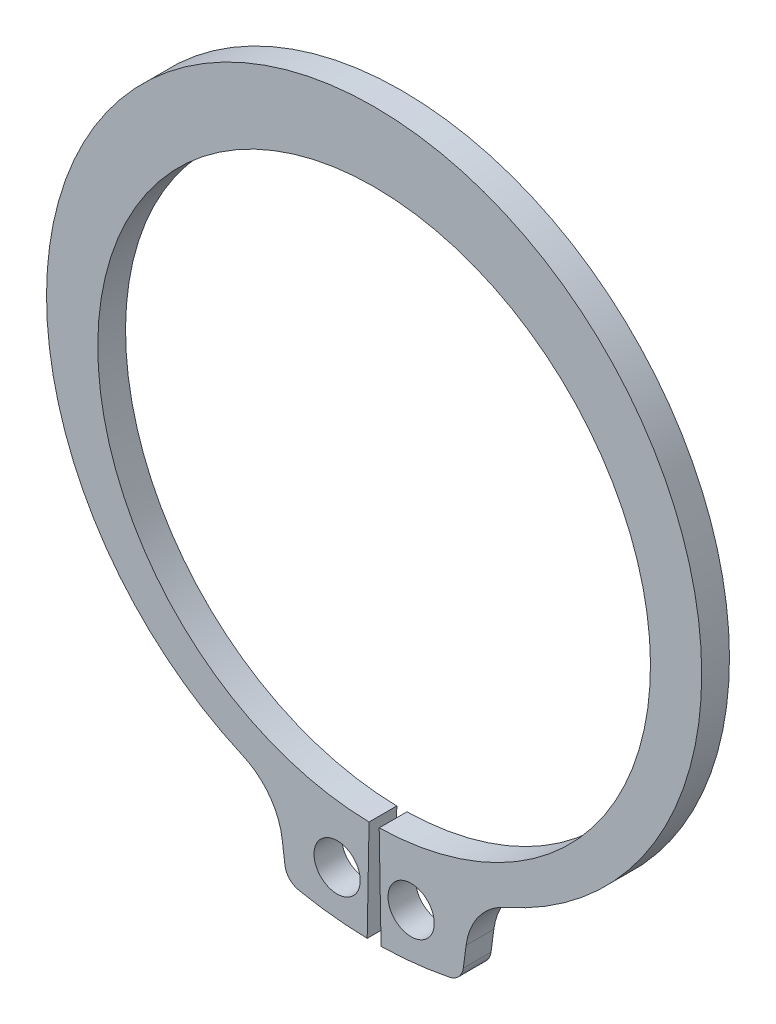
ISO-10303-21;
HEADER;
FILE_DESCRIPTION(('STEP AP214'),'2;1');
FILE_NAME('part.step','',(''),(''),'','','');
FILE_SCHEMA(('AUTOMOTIVE_DESIGN { 1 0 10303 214 1 1 1 1 }'));
ENDSEC;
DATA;
#1=APPLICATION_CONTEXT('core data for automotive mechanical design processes');
#2=APPLICATION_PROTOCOL_DEFINITION('international standard','automotive_design',2000,#1);
#3=PRODUCT_CONTEXT('',#1,'mechanical');
#4=PRODUCT('Part','Part','',(#3));
#5=PRODUCT_RELATED_PRODUCT_CATEGORY('part','',(#4));
#6=PRODUCT_DEFINITION_FORMATION('','',#4);
#7=PRODUCT_DEFINITION_CONTEXT('part definition',#1,'design');
#8=PRODUCT_DEFINITION('design','',#6,#7);
#9=PRODUCT_DEFINITION_SHAPE('','',#8);
#10=(LENGTH_UNIT() NAMED_UNIT(*) SI_UNIT(.MILLI.,.METRE.));
#11=(NAMED_UNIT(*) PLANE_ANGLE_UNIT() SI_UNIT($,.RADIAN.));
#12=(NAMED_UNIT(*) SI_UNIT($,.STERADIAN.) SOLID_ANGLE_UNIT());
#13=UNCERTAINTY_MEASURE_WITH_UNIT(LENGTH_MEASURE(1.E-05),#10,'distance_accuracy_value','');
#14=(GEOMETRIC_REPRESENTATION_CONTEXT(3) GLOBAL_UNCERTAINTY_ASSIGNED_CONTEXT((#13)) GLOBAL_UNIT_ASSIGNED_CONTEXT((#10,
#11,#12)) REPRESENTATION_CONTEXT('',''));
#15=CARTESIAN_POINT('',(0.,0.,0.));
#16=DIRECTION('',(0.,0.,1.));
#17=DIRECTION('',(1.,0.,0.));
#18=AXIS2_PLACEMENT_3D('',#15,#16,#17);
#19=CARTESIAN_POINT('',(0.,0.,-1.2));
#20=DIRECTION('',(0.,0.,1.));
#21=DIRECTION('',(1.,0.,0.));
#22=AXIS2_PLACEMENT_3D('',#19,#20,#21);
#23=CYLINDRICAL_SURFACE('',#22,11.95);
#24=CARTESIAN_POINT('',(0.,0.,0.));
#25=DIRECTION('',(0.,0.,-1.));
#26=DIRECTION('',(1.,0.,0.));
#27=AXIS2_PLACEMENT_3D('',#24,#25,#26);
#28=CIRCLE('',#27,11.95);
#29=CARTESIAN_POINT('',(-0.219266055045872,-11.947988215474,0.));
#30=VERTEX_POINT('',#29);
#31=CARTESIAN_POINT('',(0.219266055045872,-11.947988215474,0.));
#32=VERTEX_POINT('',#31);
#33=EDGE_CURVE('E155',#30,#32,#28,.T.);
#34=ORIENTED_EDGE('',*,*,#33,.F.);
#35=DIRECTION('',(0.,0.,1.));
#36=VECTOR('',#35,1.);
#37=CARTESIAN_POINT('',(-0.219266055045872,-11.947988215474,-1.2));
#38=LINE('',#37,#36);
#39=CARTESIAN_POINT('',(-0.219266055045872,-11.947988215474,-1.2));
#40=VERTEX_POINT('',#39);
#41=EDGE_CURVE('E11',#40,#30,#38,.T.);
#42=ORIENTED_EDGE('',*,*,#41,.F.);
#43=CARTESIAN_POINT('',(0.,0.,-1.2));
#44=DIRECTION('',(0.,0.,-1.));
#45=DIRECTION('',(1.,0.,0.));
#46=AXIS2_PLACEMENT_3D('',#43,#44,#45);
#47=CIRCLE('',#46,11.95);
#48=CARTESIAN_POINT('',(0.219266055045872,-11.947988215474,-1.2));
#49=VERTEX_POINT('',#48);
#50=EDGE_CURVE('E188',#40,#49,#47,.T.);
#51=ORIENTED_EDGE('',*,*,#50,.T.);
#52=DIRECTION('',(0.,0.,1.));
#53=VECTOR('',#52,1.);
#54=CARTESIAN_POINT('',(0.219266055045872,-11.947988215474,-1.2));
#55=LINE('',#54,#53);
#56=EDGE_CURVE('E37',#49,#32,#55,.T.);
#57=ORIENTED_EDGE('',*,*,#56,.T.);
#58=EDGE_LOOP('',(#34,#42,#51,#57));
#59=FACE_BOUND('',#58,.T.);
#60=ADVANCED_FACE('F34',(#59),#23,.F.);
#61=CARTESIAN_POINT('',(-0.219266055045872,-11.947988215474,-1.2));
#62=DIRECTION('',(0.999831649830457,-0.018348623853211,0.));
#63=DIRECTION('',(0.018348623853211,0.999831649830457,0.));
#64=AXIS2_PLACEMENT_3D('',#61,#62,#63);
#65=PLANE('',#64);
#66=DIRECTION('',(0.018348623853211,0.999831649830457,0.));
#67=VECTOR('',#66,1.);
#68=CARTESIAN_POINT('',(-0.219266055045872,-11.947988215474,0.));
#69=LINE('',#68,#67);
#70=CARTESIAN_POINT('',(-0.3,-16.347247474728,0.));
#71=VERTEX_POINT('',#70);
#72=EDGE_CURVE('E186',#71,#30,#69,.T.);
#73=ORIENTED_EDGE('',*,*,#72,.F.);
#74=DIRECTION('',(0.,0.,1.));
#75=VECTOR('',#74,1.);
#76=CARTESIAN_POINT('',(-0.3,-16.347247474728,-1.2));
#77=LINE('',#76,#75);
#78=CARTESIAN_POINT('',(-0.3,-16.347247474728,-1.2));
#79=VERTEX_POINT('',#78);
#80=EDGE_CURVE('E43',#79,#71,#77,.T.);
#81=ORIENTED_EDGE('',*,*,#80,.F.);
#82=DIRECTION('',(0.018348623853211,0.999831649830457,0.));
#83=VECTOR('',#82,1.);
#84=CARTESIAN_POINT('',(-0.219266055045872,-11.947988215474,-1.2));
#85=LINE('',#84,#83);
#86=EDGE_CURVE('E145',#79,#40,#85,.T.);
#87=ORIENTED_EDGE('',*,*,#86,.T.);
#88=ORIENTED_EDGE('',*,*,#41,.T.);
#89=EDGE_LOOP('',(#73,#81,#87,#88));
#90=FACE_BOUND('',#89,.T.);
#91=ADVANCED_FACE('F208',(#90),#65,.T.);
#92=CARTESIAN_POINT('',(0.,0.,-1.2));
#93=DIRECTION('',(0.,0.,1.));
#94=DIRECTION('',(1.,0.,0.));
#95=AXIS2_PLACEMENT_3D('',#92,#93,#94);
#96=CYLINDRICAL_SURFACE('',#95,16.35);
#97=CARTESIAN_POINT('',(0.,0.,0.));
#98=DIRECTION('',(0.,0.,1.));
#99=DIRECTION('',(1.,0.,0.));
#100=AXIS2_PLACEMENT_3D('',#97,#98,#99);
#101=CIRCLE('',#100,16.35);
#102=CARTESIAN_POINT('',(-3.26220764845081,-16.0212515509366,0.));
#103=VERTEX_POINT('',#102);
#104=EDGE_CURVE('E132',#103,#71,#101,.T.);
#105=ORIENTED_EDGE('',*,*,#104,.F.);
#106=DIRECTION('',(0.,0.,1.));
#107=VECTOR('',#106,1.);
#108=CARTESIAN_POINT('',(-3.26220764845081,-16.0212515509366,-1.2));
#109=LINE('',#108,#107);
#110=CARTESIAN_POINT('',(-3.26220764845081,-16.0212515509366,-1.2));
#111=VERTEX_POINT('',#110);
#112=EDGE_CURVE('E127',#111,#103,#109,.T.);
#113=ORIENTED_EDGE('',*,*,#112,.F.);
#114=CARTESIAN_POINT('',(0.,0.,-1.2));
#115=DIRECTION('',(0.,0.,1.));
#116=DIRECTION('',(1.,0.,0.));
#117=AXIS2_PLACEMENT_3D('',#114,#115,#116);
#118=CIRCLE('',#117,16.35);
#119=EDGE_CURVE('E130',#111,#79,#118,.T.);
#120=ORIENTED_EDGE('',*,*,#119,.T.);
#121=ORIENTED_EDGE('',*,*,#80,.T.);
#122=EDGE_LOOP('',(#105,#113,#120,#121));
#123=FACE_BOUND('',#122,.T.);
#124=ADVANCED_FACE('F129',(#123),#96,.T.);
#125=CARTESIAN_POINT('',(-3.11256509576958,-15.2863317550221,-1.2));
#126=DIRECTION('',(0.,0.,1.));
#127=DIRECTION('',(1.,0.,0.));
#128=AXIS2_PLACEMENT_3D('',#125,#126,#127);
#129=CYLINDRICAL_SURFACE('',#128,0.749999999999999);
#130=CARTESIAN_POINT('',(-3.11256509576958,-15.2863317550221,0.));
#131=DIRECTION('',(0.,0.,1.));
#132=DIRECTION('',(1.,0.,0.));
#133=AXIS2_PLACEMENT_3D('',#130,#131,#132);
#134=CIRCLE('',#133,0.749999999999999);
#135=CARTESIAN_POINT('',(-3.85614874179993,-15.3842263991871,0.));
#136=VERTEX_POINT('',#135);
#137=EDGE_CURVE('E183',#136,#103,#134,.T.);
#138=ORIENTED_EDGE('',*,*,#137,.F.);
#139=DIRECTION('',(0.,0.,1.));
#140=VECTOR('',#139,1.);
#141=CARTESIAN_POINT('',(-3.85614874179993,-15.3842263991871,-1.2));
#142=LINE('',#141,#140);
#143=CARTESIAN_POINT('',(-3.85614874179993,-15.3842263991871,-1.2));
#144=VERTEX_POINT('',#143);
#145=EDGE_CURVE('E137',#144,#136,#142,.T.);
#146=ORIENTED_EDGE('',*,*,#145,.F.);
#147=CARTESIAN_POINT('',(-3.11256509576958,-15.2863317550221,-1.2));
#148=DIRECTION('',(0.,0.,1.));
#149=DIRECTION('',(1.,0.,0.));
#150=AXIS2_PLACEMENT_3D('',#147,#148,#149);
#151=CIRCLE('',#150,0.749999999999999);
#152=EDGE_CURVE('E143',#144,#111,#151,.T.);
#153=ORIENTED_EDGE('',*,*,#152,.T.);
#154=ORIENTED_EDGE('',*,*,#112,.T.);
#155=EDGE_LOOP('',(#138,#146,#153,#154));
#156=FACE_BOUND('',#155,.T.);
#157=ADVANCED_FACE('F147',(#156),#129,.T.);
#158=CARTESIAN_POINT('',(-3.97693703630096,-14.4667482144619,-1.2));
#159=DIRECTION('',(-0.99144486137381,-0.130526192220052,0.));
#160=DIRECTION('',(0.130526192220052,-0.99144486137381,0.));
#161=AXIS2_PLACEMENT_3D('',#158,#159,#160);
#162=PLANE('',#161);
#163=DIRECTION('',(0.130526192220052,-0.99144486137381,0.));
#164=VECTOR('',#163,1.);
#165=CARTESIAN_POINT('',(-3.97693703630096,-14.4667482144619,0.));
#166=LINE('',#165,#164);
#167=CARTESIAN_POINT('',(-3.97693703630096,-14.4667482144619,0.));
#168=VERTEX_POINT('',#167);
#169=EDGE_CURVE('E180',#168,#136,#166,.T.);
#170=ORIENTED_EDGE('',*,*,#169,.F.);
#171=DIRECTION('',(0.,0.,1.));
#172=VECTOR('',#171,1.);
#173=CARTESIAN_POINT('',(-3.97693703630096,-14.4667482144619,-1.2));
#174=LINE('',#173,#172);
#175=CARTESIAN_POINT('',(-3.97693703630096,-14.4667482144619,-1.2));
#176=VERTEX_POINT('',#175);
#177=EDGE_CURVE('E192',#176,#168,#174,.T.);
#178=ORIENTED_EDGE('',*,*,#177,.F.);
#179=DIRECTION('',(0.130526192220052,-0.99144486137381,0.));
#180=VECTOR('',#179,1.);
#181=CARTESIAN_POINT('',(-3.97693703630096,-14.4667482144619,-1.2));
#182=LINE('',#181,#180);
#183=EDGE_CURVE('E148',#176,#144,#182,.T.);
#184=ORIENTED_EDGE('',*,*,#183,.T.);
#185=ORIENTED_EDGE('',*,*,#145,.T.);
#186=EDGE_LOOP('',(#170,#178,#184,#185));
#187=FACE_BOUND('',#186,.T.);
#188=ADVANCED_FACE('F221',(#187),#162,.T.);
#189=CARTESIAN_POINT('',(-6.85148488902955,-14.8451896187081,-1.2));
#190=DIRECTION('',(0.,0.,1.));
#191=DIRECTION('',(1.,0.,0.));
#192=AXIS2_PLACEMENT_3D('',#189,#190,#191);
#193=CYLINDRICAL_SURFACE('',#192,2.89935221283555);
#194=CARTESIAN_POINT('',(-6.85148488902955,-14.8451896187081,0.));
#195=DIRECTION('',(0.,0.,-1.));
#196=DIRECTION('',(1.,0.,0.));
#197=AXIS2_PLACEMENT_3D('',#194,#195,#196);
#198=CIRCLE('',#197,2.89935221283555);
#199=CARTESIAN_POINT('',(-5.68742578993164,-12.1897782253678,0.));
#200=VERTEX_POINT('',#199);
#201=EDGE_CURVE('E177',#200,#168,#198,.T.);
#202=ORIENTED_EDGE('',*,*,#201,.F.);
#203=DIRECTION('',(0.,0.,1.));
#204=VECTOR('',#203,1.);
#205=CARTESIAN_POINT('',(-5.68742578993164,-12.1897782253678,-1.2));
#206=LINE('',#205,#204);
#207=CARTESIAN_POINT('',(-5.68742578993164,-12.1897782253678,-1.2));
#208=VERTEX_POINT('',#207);
#209=EDGE_CURVE('E194',#208,#200,#206,.T.);
#210=ORIENTED_EDGE('',*,*,#209,.F.);
#211=CARTESIAN_POINT('',(-6.85148488902955,-14.8451896187081,-1.2));
#212=DIRECTION('',(0.,0.,-1.));
#213=DIRECTION('',(1.,0.,0.));
#214=AXIS2_PLACEMENT_3D('',#211,#212,#213);
#215=CIRCLE('',#214,2.89935221283555);
#216=EDGE_CURVE('E150',#208,#176,#215,.T.);
#217=ORIENTED_EDGE('',*,*,#216,.T.);
#218=ORIENTED_EDGE('',*,*,#177,.T.);
#219=EDGE_LOOP('',(#202,#210,#217,#218));
#220=FACE_BOUND('',#219,.T.);
#221=ADVANCED_FACE('F224',(#220),#193,.F.);
#222=CARTESIAN_POINT('',(0.,0.784180960266359,-1.2));
#223=DIRECTION('',(0.,0.,1.));
#224=DIRECTION('',(1.,0.,0.));
#225=AXIS2_PLACEMENT_3D('',#222,#223,#224);
#226=CYLINDRICAL_SURFACE('',#225,14.1658190397336);
#227=CARTESIAN_POINT('',(0.,0.784180960266359,0.));
#228=DIRECTION('',(0.,0.,1.));
#229=DIRECTION('',(1.,0.,0.));
#230=AXIS2_PLACEMENT_3D('',#227,#228,#229);
#231=CIRCLE('',#230,14.1658190397336);
#232=CARTESIAN_POINT('',(5.68742578993164,-12.1897782253678,0.));
#233=VERTEX_POINT('',#232);
#234=EDGE_CURVE('E174',#233,#200,#231,.T.);
#235=ORIENTED_EDGE('',*,*,#234,.F.);
#236=DIRECTION('',(0.,0.,1.));
#237=VECTOR('',#236,1.);
#238=CARTESIAN_POINT('',(5.68742578993164,-12.1897782253678,-1.2));
#239=LINE('',#238,#237);
#240=CARTESIAN_POINT('',(5.68742578993164,-12.1897782253678,-1.2));
#241=VERTEX_POINT('',#240);
#242=EDGE_CURVE('E196',#241,#233,#239,.T.);
#243=ORIENTED_EDGE('',*,*,#242,.F.);
#244=CARTESIAN_POINT('',(0.,0.784180960266359,-1.2));
#245=DIRECTION('',(0.,0.,1.));
#246=DIRECTION('',(1.,0.,0.));
#247=AXIS2_PLACEMENT_3D('',#244,#245,#246);
#248=CIRCLE('',#247,14.1658190397336);
#249=EDGE_CURVE('E298',#241,#208,#248,.T.);
#250=ORIENTED_EDGE('',*,*,#249,.T.);
#251=ORIENTED_EDGE('',*,*,#209,.T.);
#252=EDGE_LOOP('',(#235,#243,#250,#251));
#253=FACE_BOUND('',#252,.T.);
#254=ADVANCED_FACE('F228',(#253),#226,.T.);
#255=CARTESIAN_POINT('',(6.85148488902955,-14.8451896187081,-1.2));
#256=DIRECTION('',(0.,0.,1.));
#257=DIRECTION('',(1.,0.,0.));
#258=AXIS2_PLACEMENT_3D('',#255,#256,#257);
#259=CYLINDRICAL_SURFACE('',#258,2.89935221283555);
#260=CARTESIAN_POINT('',(6.85148488902955,-14.8451896187081,0.));
#261=DIRECTION('',(0.,0.,-1.));
#262=DIRECTION('',(1.,0.,0.));
#263=AXIS2_PLACEMENT_3D('',#260,#261,#262);
#264=CIRCLE('',#263,2.89935221283555);
#265=CARTESIAN_POINT('',(3.97693703630096,-14.4667482144619,0.));
#266=VERTEX_POINT('',#265);
#267=EDGE_CURVE('E171',#266,#233,#264,.T.);
#268=ORIENTED_EDGE('',*,*,#267,.F.);
#269=DIRECTION('',(0.,0.,1.));
#270=VECTOR('',#269,1.);
#271=CARTESIAN_POINT('',(3.97693703630096,-14.4667482144619,-1.2));
#272=LINE('',#271,#270);
#273=CARTESIAN_POINT('',(3.97693703630096,-14.4667482144619,-1.2));
#274=VERTEX_POINT('',#273);
#275=EDGE_CURVE('E198',#274,#266,#272,.T.);
#276=ORIENTED_EDGE('',*,*,#275,.F.);
#277=CARTESIAN_POINT('',(6.85148488902955,-14.8451896187081,-1.2));
#278=DIRECTION('',(0.,0.,-1.));
#279=DIRECTION('',(1.,0.,0.));
#280=AXIS2_PLACEMENT_3D('',#277,#278,#279);
#281=CIRCLE('',#280,2.89935221283555);
#282=EDGE_CURVE('E295',#274,#241,#281,.T.);
#283=ORIENTED_EDGE('',*,*,#282,.T.);
#284=ORIENTED_EDGE('',*,*,#242,.T.);
#285=EDGE_LOOP('',(#268,#276,#283,#284));
#286=FACE_BOUND('',#285,.T.);
#287=ADVANCED_FACE('F232',(#286),#259,.F.);
#288=CARTESIAN_POINT('',(3.97693703630096,-14.4667482144619,-1.2));
#289=DIRECTION('',(0.99144486137381,-0.130526192220052,0.));
#290=DIRECTION('',(0.130526192220052,0.99144486137381,0.));
#291=AXIS2_PLACEMENT_3D('',#288,#289,#290);
#292=PLANE('',#291);
#293=DIRECTION('',(0.130526192220052,0.99144486137381,0.));
#294=VECTOR('',#293,1.);
#295=CARTESIAN_POINT('',(3.97693703630096,-14.4667482144619,0.));
#296=LINE('',#295,#294);
#297=CARTESIAN_POINT('',(3.85614874179993,-15.3842263991871,0.));
#298=VERTEX_POINT('',#297);
#299=EDGE_CURVE('E168',#298,#266,#296,.T.);
#300=ORIENTED_EDGE('',*,*,#299,.F.);
#301=DIRECTION('',(0.,0.,1.));
#302=VECTOR('',#301,1.);
#303=CARTESIAN_POINT('',(3.85614874179993,-15.3842263991871,-1.2));
#304=LINE('',#303,#302);
#305=CARTESIAN_POINT('',(3.85614874179993,-15.3842263991871,-1.2));
#306=VERTEX_POINT('',#305);
#307=EDGE_CURVE('E200',#306,#298,#304,.T.);
#308=ORIENTED_EDGE('',*,*,#307,.F.);
#309=DIRECTION('',(0.130526192220052,0.99144486137381,0.));
#310=VECTOR('',#309,1.);
#311=CARTESIAN_POINT('',(3.97693703630096,-14.4667482144619,-1.2));
#312=LINE('',#311,#310);
#313=EDGE_CURVE('E292',#306,#274,#312,.T.);
#314=ORIENTED_EDGE('',*,*,#313,.T.);
#315=ORIENTED_EDGE('',*,*,#275,.T.);
#316=EDGE_LOOP('',(#300,#308,#314,#315));
#317=FACE_BOUND('',#316,.T.);
#318=ADVANCED_FACE('F236',(#317),#292,.T.);
#319=CARTESIAN_POINT('',(3.11256509576958,-15.2863317550221,-1.2));
#320=DIRECTION('',(0.,0.,1.));
#321=DIRECTION('',(1.,0.,0.));
#322=AXIS2_PLACEMENT_3D('',#319,#320,#321);
#323=CYLINDRICAL_SURFACE('',#322,0.749999999999999);
#324=CARTESIAN_POINT('',(3.11256509576958,-15.2863317550221,0.));
#325=DIRECTION('',(0.,0.,1.));
#326=DIRECTION('',(-1.,0.,0.));
#327=AXIS2_PLACEMENT_3D('',#324,#325,#326);
#328=CIRCLE('',#327,0.749999999999999);
#329=CARTESIAN_POINT('',(3.26220764845081,-16.0212515509366,0.));
#330=VERTEX_POINT('',#329);
#331=EDGE_CURVE('E165',#330,#298,#328,.T.);
#332=ORIENTED_EDGE('',*,*,#331,.F.);
#333=DIRECTION('',(0.,0.,1.));
#334=VECTOR('',#333,1.);
#335=CARTESIAN_POINT('',(3.26220764845081,-16.0212515509366,-1.2));
#336=LINE('',#335,#334);
#337=CARTESIAN_POINT('',(3.26220764845081,-16.0212515509366,-1.2));
#338=VERTEX_POINT('',#337);
#339=EDGE_CURVE('E202',#338,#330,#336,.T.);
#340=ORIENTED_EDGE('',*,*,#339,.F.);
#341=CARTESIAN_POINT('',(3.11256509576958,-15.2863317550221,-1.2));
#342=DIRECTION('',(0.,0.,1.));
#343=DIRECTION('',(-1.,0.,0.));
#344=AXIS2_PLACEMENT_3D('',#341,#342,#343);
#345=CIRCLE('',#344,0.749999999999999);
#346=EDGE_CURVE('E289',#338,#306,#345,.T.);
#347=ORIENTED_EDGE('',*,*,#346,.T.);
#348=ORIENTED_EDGE('',*,*,#307,.T.);
#349=EDGE_LOOP('',(#332,#340,#347,#348));
#350=FACE_BOUND('',#349,.T.);
#351=ADVANCED_FACE('F240',(#350),#323,.T.);
#352=CARTESIAN_POINT('',(0.,0.,-1.2));
#353=DIRECTION('',(0.,0.,1.));
#354=DIRECTION('',(1.,0.,0.));
#355=AXIS2_PLACEMENT_3D('',#352,#353,#354);
#356=CYLINDRICAL_SURFACE('',#355,16.35);
#357=CARTESIAN_POINT('',(0.,0.,0.));
#358=DIRECTION('',(0.,0.,1.));
#359=DIRECTION('',(1.,0.,0.));
#360=AXIS2_PLACEMENT_3D('',#357,#358,#359);
#361=CIRCLE('',#360,16.35);
#362=CARTESIAN_POINT('',(0.299999999999997,-16.347247474728,0.));
#363=VERTEX_POINT('',#362);
#364=EDGE_CURVE('E162',#363,#330,#361,.T.);
#365=ORIENTED_EDGE('',*,*,#364,.F.);
#366=DIRECTION('',(0.,0.,1.));
#367=VECTOR('',#366,1.);
#368=CARTESIAN_POINT('',(0.299999999999997,-16.347247474728,-1.2));
#369=LINE('',#368,#367);
#370=CARTESIAN_POINT('',(0.299999999999997,-16.347247474728,-1.2));
#371=VERTEX_POINT('',#370);
#372=EDGE_CURVE('E203',#371,#363,#369,.T.);
#373=ORIENTED_EDGE('',*,*,#372,.F.);
#374=CARTESIAN_POINT('',(0.,0.,-1.2));
#375=DIRECTION('',(0.,0.,1.));
#376=DIRECTION('',(1.,0.,0.));
#377=AXIS2_PLACEMENT_3D('',#374,#375,#376);
#378=CIRCLE('',#377,16.35);
#379=EDGE_CURVE('E286',#371,#338,#378,.T.);
#380=ORIENTED_EDGE('',*,*,#379,.T.);
#381=ORIENTED_EDGE('',*,*,#339,.T.);
#382=EDGE_LOOP('',(#365,#373,#380,#381));
#383=FACE_BOUND('',#382,.T.);
#384=ADVANCED_FACE('F244',(#383),#356,.T.);
#385=CARTESIAN_POINT('',(0.219266055045872,-11.947988215474,-1.2));
#386=DIRECTION('',(-0.999831649830457,-0.018348623853211,0.));
#387=DIRECTION('',(0.018348623853211,-0.999831649830457,0.));
#388=AXIS2_PLACEMENT_3D('',#385,#386,#387);
#389=PLANE('',#388);
#390=DIRECTION('',(0.018348623853211,-0.999831649830457,0.));
#391=VECTOR('',#390,1.);
#392=CARTESIAN_POINT('',(0.219266055045872,-11.947988215474,0.));
#393=LINE('',#392,#391);
#394=EDGE_CURVE('E158',#32,#363,#393,.T.);
#395=ORIENTED_EDGE('',*,*,#394,.F.);
#396=ORIENTED_EDGE('',*,*,#56,.F.);
#397=DIRECTION('',(0.018348623853211,-0.999831649830457,0.));
#398=VECTOR('',#397,1.);
#399=CARTESIAN_POINT('',(0.219266055045872,-11.947988215474,-1.2));
#400=LINE('',#399,#398);
#401=EDGE_CURVE('E284',#49,#371,#400,.T.);
#402=ORIENTED_EDGE('',*,*,#401,.T.);
#403=ORIENTED_EDGE('',*,*,#372,.T.);
#404=EDGE_LOOP('',(#395,#396,#402,#403));
#405=FACE_BOUND('',#404,.T.);
#406=ADVANCED_FACE('F205',(#405),#389,.T.);
#407=CARTESIAN_POINT('',(0.,0.,-1.2));
#408=DIRECTION('',(0.,0.,1.));
#409=DIRECTION('',(1.,0.,0.));
#410=AXIS2_PLACEMENT_3D('',#407,#408,#409);
#411=PLANE('',#410);
#412=CARTESIAN_POINT('',(-1.6,-14.335990548267,-1.2));
#413=DIRECTION('',(0.,0.,1.));
#414=DIRECTION('',(1.,0.,0.));
#415=AXIS2_PLACEMENT_3D('',#412,#413,#414);
#416=CIRCLE('',#415,1.);
#417=CARTESIAN_POINT('',(-0.6,-14.335990548267,-1.2));
#418=VERTEX_POINT('',#417);
#419=EDGE_CURVE('E271',#418,#418,#416,.T.);
#420=ORIENTED_EDGE('',*,*,#419,.T.);
#421=EDGE_LOOP('',(#420));
#422=FACE_BOUND('',#421,.T.);
#423=CARTESIAN_POINT('',(1.6,-14.335990548267,-1.2));
#424=DIRECTION('',(0.,0.,1.));
#425=DIRECTION('',(1.,0.,0.));
#426=AXIS2_PLACEMENT_3D('',#423,#424,#425);
#427=CIRCLE('',#426,1.);
#428=CARTESIAN_POINT('',(2.6,-14.335990548267,-1.2));
#429=VERTEX_POINT('',#428);
#430=EDGE_CURVE('E159',#429,#429,#427,.T.);
#431=ORIENTED_EDGE('',*,*,#430,.T.);
#432=EDGE_LOOP('',(#431));
#433=FACE_BOUND('',#432,.T.);
#434=ORIENTED_EDGE('',*,*,#50,.F.);
#435=ORIENTED_EDGE('',*,*,#86,.F.);
#436=ORIENTED_EDGE('',*,*,#119,.F.);
#437=ORIENTED_EDGE('',*,*,#152,.F.);
#438=ORIENTED_EDGE('',*,*,#183,.F.);
#439=ORIENTED_EDGE('',*,*,#216,.F.);
#440=ORIENTED_EDGE('',*,*,#249,.F.);
#441=ORIENTED_EDGE('',*,*,#282,.F.);
#442=ORIENTED_EDGE('',*,*,#313,.F.);
#443=ORIENTED_EDGE('',*,*,#346,.F.);
#444=ORIENTED_EDGE('',*,*,#379,.F.);
#445=ORIENTED_EDGE('',*,*,#401,.F.);
#446=EDGE_LOOP('',(#434,#435,#436,#437,#438,#439,#440,#441,#442,#443,#444,#445));
#447=FACE_BOUND('',#446,.T.);
#448=ADVANCED_FACE('F141',(#422,#433,#447),#411,.F.);
#449=CARTESIAN_POINT('',(0.,0.,0.));
#450=DIRECTION('',(0.,0.,1.));
#451=DIRECTION('',(1.,0.,0.));
#452=AXIS2_PLACEMENT_3D('',#449,#450,#451);
#453=PLANE('',#452);
#454=CARTESIAN_POINT('',(-1.6,-14.335990548267,0.));
#455=DIRECTION('',(0.,0.,1.));
#456=DIRECTION('',(1.,0.,0.));
#457=AXIS2_PLACEMENT_3D('',#454,#455,#456);
#458=CIRCLE('',#457,1.);
#459=CARTESIAN_POINT('',(-0.6,-14.335990548267,0.));
#460=VERTEX_POINT('',#459);
#461=EDGE_CURVE('E274',#460,#460,#458,.T.);
#462=ORIENTED_EDGE('',*,*,#461,.F.);
#463=EDGE_LOOP('',(#462));
#464=FACE_BOUND('',#463,.T.);
#465=CARTESIAN_POINT('',(1.6,-14.335990548267,0.));
#466=DIRECTION('',(0.,0.,1.));
#467=DIRECTION('',(1.,0.,0.));
#468=AXIS2_PLACEMENT_3D('',#465,#466,#467);
#469=CIRCLE('',#468,1.);
#470=CARTESIAN_POINT('',(2.6,-14.335990548267,0.));
#471=VERTEX_POINT('',#470);
#472=EDGE_CURVE('E276',#471,#471,#469,.T.);
#473=ORIENTED_EDGE('',*,*,#472,.F.);
#474=EDGE_LOOP('',(#473));
#475=FACE_BOUND('',#474,.T.);
#476=ORIENTED_EDGE('',*,*,#33,.T.);
#477=ORIENTED_EDGE('',*,*,#394,.T.);
#478=ORIENTED_EDGE('',*,*,#364,.T.);
#479=ORIENTED_EDGE('',*,*,#331,.T.);
#480=ORIENTED_EDGE('',*,*,#299,.T.);
#481=ORIENTED_EDGE('',*,*,#267,.T.);
#482=ORIENTED_EDGE('',*,*,#234,.T.);
#483=ORIENTED_EDGE('',*,*,#201,.T.);
#484=ORIENTED_EDGE('',*,*,#169,.T.);
#485=ORIENTED_EDGE('',*,*,#137,.T.);
#486=ORIENTED_EDGE('',*,*,#104,.T.);
#487=ORIENTED_EDGE('',*,*,#72,.T.);
#488=EDGE_LOOP('',(#476,#477,#478,#479,#480,#481,#482,#483,#484,#485,#486,#487));
#489=FACE_BOUND('',#488,.T.);
#490=ADVANCED_FACE('F207',(#464,#475,#489),#453,.T.);
#491=CARTESIAN_POINT('',(1.6,-14.335990548267,-1.2));
#492=DIRECTION('',(0.,0.,1.));
#493=DIRECTION('',(1.,0.,0.));
#494=AXIS2_PLACEMENT_3D('',#491,#492,#493);
#495=CYLINDRICAL_SURFACE('',#494,1.);
#496=ORIENTED_EDGE('',*,*,#430,.F.);
#497=EDGE_LOOP('',(#496));
#498=FACE_BOUND('',#497,.T.);
#499=ORIENTED_EDGE('',*,*,#472,.T.);
#500=EDGE_LOOP('',(#499));
#501=FACE_BOUND('',#500,.T.);
#502=ADVANCED_FACE('F256',(#498,#501),#495,.F.);
#503=CARTESIAN_POINT('',(-1.6,-14.335990548267,-1.2));
#504=DIRECTION('',(0.,0.,1.));
#505=DIRECTION('',(1.,0.,0.));
#506=AXIS2_PLACEMENT_3D('',#503,#504,#505);
#507=CYLINDRICAL_SURFACE('',#506,1.);
#508=ORIENTED_EDGE('',*,*,#419,.F.);
#509=EDGE_LOOP('',(#508));
#510=FACE_BOUND('',#509,.T.);
#511=ORIENTED_EDGE('',*,*,#461,.T.);
#512=EDGE_LOOP('',(#511));
#513=FACE_BOUND('',#512,.T.);
#514=ADVANCED_FACE('F263',(#510,#513),#507,.F.);
#515=CLOSED_SHELL('',(#60,#91,#124,#157,#188,#221,#254,#287,#318,#351,#384,#406,#448,#490,#502,#514));
#516=MANIFOLD_SOLID_BREP('B2',#515);
#517=ADVANCED_BREP_SHAPE_REPRESENTATION('',(#18,#516),#14);
#518=SHAPE_DEFINITION_REPRESENTATION(#9,#517);
ENDSEC;
END-ISO-10303-21;
